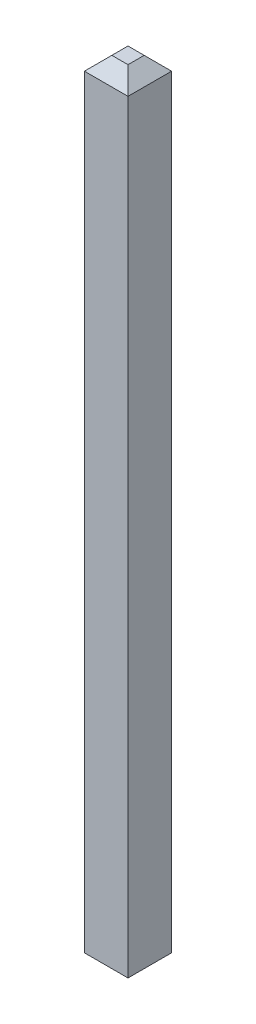
ISO-10303-21;
HEADER;
FILE_DESCRIPTION(('STEP AP214'),'2;1');
FILE_NAME('part.step','',(''),(''),'','','');
FILE_SCHEMA(('AUTOMOTIVE_DESIGN { 1 0 10303 214 1 1 1 1 }'));
ENDSEC;
DATA;
#1=APPLICATION_CONTEXT('core data for automotive mechanical design processes');
#2=APPLICATION_PROTOCOL_DEFINITION('international standard','automotive_design',2000,#1);
#3=PRODUCT_CONTEXT('',#1,'mechanical');
#4=PRODUCT('Part','Part','',(#3));
#5=PRODUCT_RELATED_PRODUCT_CATEGORY('part','',(#4));
#6=PRODUCT_DEFINITION_FORMATION('','',#4);
#7=PRODUCT_DEFINITION_CONTEXT('part definition',#1,'design');
#8=PRODUCT_DEFINITION('design','',#6,#7);
#9=PRODUCT_DEFINITION_SHAPE('','',#8);
#10=(LENGTH_UNIT() NAMED_UNIT(*) SI_UNIT(.MILLI.,.METRE.));
#11=(NAMED_UNIT(*) PLANE_ANGLE_UNIT() SI_UNIT($,.RADIAN.));
#12=(NAMED_UNIT(*) SI_UNIT($,.STERADIAN.) SOLID_ANGLE_UNIT());
#13=UNCERTAINTY_MEASURE_WITH_UNIT(LENGTH_MEASURE(1.E-05),#10,'distance_accuracy_value','');
#14=(GEOMETRIC_REPRESENTATION_CONTEXT(3) GLOBAL_UNCERTAINTY_ASSIGNED_CONTEXT((#13)) GLOBAL_UNIT_ASSIGNED_CONTEXT((#10,
#11,#12)) REPRESENTATION_CONTEXT('',''));
#15=CARTESIAN_POINT('',(0.,0.,0.));
#16=DIRECTION('',(0.,0.,1.));
#17=DIRECTION('',(1.,0.,0.));
#18=AXIS2_PLACEMENT_3D('',#15,#16,#17);
#19=CARTESIAN_POINT('',(0.,11.54,0.));
#20=DIRECTION('',(1.,0.,0.));
#21=DIRECTION('',(0.,0.,-1.));
#22=AXIS2_PLACEMENT_3D('',#19,#20,#21);
#23=PLANE('',#22);
#24=DIRECTION('',(0.,-1.,0.));
#25=VECTOR('',#24,1.);
#26=CARTESIAN_POINT('',(0.,11.54,0.636));
#27=LINE('',#26,#25);
#28=CARTESIAN_POINT('',(0.,11.34,0.636));
#29=VERTEX_POINT('',#28);
#30=CARTESIAN_POINT('',(0.,0.199999999999999,0.636));
#31=VERTEX_POINT('',#30);
#32=EDGE_CURVE('E128',#29,#31,#27,.T.);
#33=ORIENTED_EDGE('',*,*,#32,.F.);
#34=DIRECTION('',(0.,0.,-1.));
#35=VECTOR('',#34,1.);
#36=CARTESIAN_POINT('',(0.,11.34,0.));
#37=LINE('',#36,#35);
#38=CARTESIAN_POINT('',(0.,11.34,0.));
#39=VERTEX_POINT('',#38);
#40=EDGE_CURVE('E153',#29,#39,#37,.T.);
#41=ORIENTED_EDGE('',*,*,#40,.T.);
#42=DIRECTION('',(0.,-1.,0.));
#43=VECTOR('',#42,1.);
#44=CARTESIAN_POINT('',(0.,11.54,0.));
#45=LINE('',#44,#43);
#46=CARTESIAN_POINT('',(0.,0.199999999999999,0.));
#47=VERTEX_POINT('',#46);
#48=EDGE_CURVE('E122',#39,#47,#45,.T.);
#49=ORIENTED_EDGE('',*,*,#48,.T.);
#50=DIRECTION('',(0.,0.,1.));
#51=VECTOR('',#50,1.);
#52=CARTESIAN_POINT('',(0.,0.199999999999999,0.));
#53=LINE('',#52,#51);
#54=EDGE_CURVE('E150',#47,#31,#53,.T.);
#55=ORIENTED_EDGE('',*,*,#54,.T.);
#56=EDGE_LOOP('',(#33,#41,#49,#55));
#57=FACE_BOUND('',#56,.T.);
#58=ADVANCED_FACE('F36',(#57),#23,.F.);
#59=CARTESIAN_POINT('',(0.,11.54,0.636));
#60=DIRECTION('',(0.,0.,-1.));
#61=DIRECTION('',(-1.,0.,0.));
#62=AXIS2_PLACEMENT_3D('',#59,#60,#61);
#63=PLANE('',#62);
#64=DIRECTION('',(0.,-1.,0.));
#65=VECTOR('',#64,1.);
#66=CARTESIAN_POINT('',(0.636,11.54,0.636));
#67=LINE('',#66,#65);
#68=CARTESIAN_POINT('',(0.636,11.34,0.636));
#69=VERTEX_POINT('',#68);
#70=CARTESIAN_POINT('',(0.636,0.199999999999999,0.636));
#71=VERTEX_POINT('',#70);
#72=EDGE_CURVE('E131',#69,#71,#67,.T.);
#73=ORIENTED_EDGE('',*,*,#72,.F.);
#74=DIRECTION('',(-1.,0.,0.));
#75=VECTOR('',#74,1.);
#76=CARTESIAN_POINT('',(0.,11.34,0.636));
#77=LINE('',#76,#75);
#78=EDGE_CURVE('E140',#69,#29,#77,.T.);
#79=ORIENTED_EDGE('',*,*,#78,.T.);
#80=ORIENTED_EDGE('',*,*,#32,.T.);
#81=DIRECTION('',(1.,0.,0.));
#82=VECTOR('',#81,1.);
#83=CARTESIAN_POINT('',(0.,0.199999999999999,0.636));
#84=LINE('',#83,#82);
#85=EDGE_CURVE('E138',#31,#71,#84,.T.);
#86=ORIENTED_EDGE('',*,*,#85,.T.);
#87=EDGE_LOOP('',(#73,#79,#80,#86));
#88=FACE_BOUND('',#87,.T.);
#89=ADVANCED_FACE('F190',(#88),#63,.F.);
#90=CARTESIAN_POINT('',(0.636,11.54,0.));
#91=DIRECTION('',(-1.,0.,0.));
#92=DIRECTION('',(0.,0.,1.));
#93=AXIS2_PLACEMENT_3D('',#90,#91,#92);
#94=PLANE('',#93);
#95=DIRECTION('',(0.,-1.,0.));
#96=VECTOR('',#95,1.);
#97=CARTESIAN_POINT('',(0.636,11.54,0.));
#98=LINE('',#97,#96);
#99=CARTESIAN_POINT('',(0.636,11.34,0.));
#100=VERTEX_POINT('',#99);
#101=CARTESIAN_POINT('',(0.636,0.199999999999999,0.));
#102=VERTEX_POINT('',#101);
#103=EDGE_CURVE('E202',#100,#102,#98,.T.);
#104=ORIENTED_EDGE('',*,*,#103,.F.);
#105=DIRECTION('',(0.,0.,1.));
#106=VECTOR('',#105,1.);
#107=CARTESIAN_POINT('',(0.636,11.34,0.636));
#108=LINE('',#107,#106);
#109=EDGE_CURVE('E145',#100,#69,#108,.T.);
#110=ORIENTED_EDGE('',*,*,#109,.T.);
#111=ORIENTED_EDGE('',*,*,#72,.T.);
#112=DIRECTION('',(0.,0.,-1.));
#113=VECTOR('',#112,1.);
#114=CARTESIAN_POINT('',(0.636,0.199999999999999,0.));
#115=LINE('',#114,#113);
#116=EDGE_CURVE('E143',#71,#102,#115,.T.);
#117=ORIENTED_EDGE('',*,*,#116,.T.);
#118=EDGE_LOOP('',(#104,#110,#111,#117));
#119=FACE_BOUND('',#118,.T.);
#120=ADVANCED_FACE('F200',(#119),#94,.F.);
#121=CARTESIAN_POINT('',(0.,11.54,0.));
#122=DIRECTION('',(0.,0.,1.));
#123=DIRECTION('',(1.,0.,0.));
#124=AXIS2_PLACEMENT_3D('',#121,#122,#123);
#125=PLANE('',#124);
#126=ORIENTED_EDGE('',*,*,#48,.F.);
#127=DIRECTION('',(1.,0.,0.));
#128=VECTOR('',#127,1.);
#129=CARTESIAN_POINT('',(0.636,11.34,0.));
#130=LINE('',#129,#128);
#131=EDGE_CURVE('E119',#39,#100,#130,.T.);
#132=ORIENTED_EDGE('',*,*,#131,.T.);
#133=ORIENTED_EDGE('',*,*,#103,.T.);
#134=DIRECTION('',(-1.,0.,0.));
#135=VECTOR('',#134,1.);
#136=CARTESIAN_POINT('',(0.,0.199999999999999,0.));
#137=LINE('',#136,#135);
#138=EDGE_CURVE('E147',#102,#47,#137,.T.);
#139=ORIENTED_EDGE('',*,*,#138,.T.);
#140=EDGE_LOOP('',(#126,#132,#133,#139));
#141=FACE_BOUND('',#140,.T.);
#142=ADVANCED_FACE('F206',(#141),#125,.F.);
#143=CARTESIAN_POINT('',(0.,11.54,0.));
#144=DIRECTION('',(0.,1.,0.));
#145=DIRECTION('',(0.,0.,1.));
#146=AXIS2_PLACEMENT_3D('',#143,#144,#145);
#147=PLANE('',#146);
#148=DIRECTION('',(0.,0.,1.));
#149=VECTOR('',#148,1.);
#150=CARTESIAN_POINT('',(0.199999999999999,11.54,0.636));
#151=LINE('',#150,#149);
#152=CARTESIAN_POINT('',(0.199999999999999,11.54,0.199999999999999));
#153=VERTEX_POINT('',#152);
#154=CARTESIAN_POINT('',(0.199999999999999,11.54,0.436000000000001));
#155=VERTEX_POINT('',#154);
#156=EDGE_CURVE('E107',#153,#155,#151,.T.);
#157=ORIENTED_EDGE('',*,*,#156,.T.);
#158=DIRECTION('',(1.,0.,0.));
#159=VECTOR('',#158,1.);
#160=CARTESIAN_POINT('',(0.636,11.54,0.436000000000001));
#161=LINE('',#160,#159);
#162=CARTESIAN_POINT('',(0.436000000000001,11.54,0.436000000000001));
#163=VERTEX_POINT('',#162);
#164=EDGE_CURVE('E136',#155,#163,#161,.T.);
#165=ORIENTED_EDGE('',*,*,#164,.T.);
#166=DIRECTION('',(0.,0.,-1.));
#167=VECTOR('',#166,1.);
#168=CARTESIAN_POINT('',(0.436000000000001,11.54,0.));
#169=LINE('',#168,#167);
#170=CARTESIAN_POINT('',(0.436000000000001,11.54,0.199999999999999));
#171=VERTEX_POINT('',#170);
#172=EDGE_CURVE('E110',#163,#171,#169,.T.);
#173=ORIENTED_EDGE('',*,*,#172,.T.);
#174=DIRECTION('',(-1.,0.,0.));
#175=VECTOR('',#174,1.);
#176=CARTESIAN_POINT('',(0.,11.54,0.199999999999999));
#177=LINE('',#176,#175);
#178=EDGE_CURVE('E102',#171,#153,#177,.T.);
#179=ORIENTED_EDGE('',*,*,#178,.T.);
#180=EDGE_LOOP('',(#157,#165,#173,#179));
#181=FACE_BOUND('',#180,.T.);
#182=ADVANCED_FACE('F104',(#181),#147,.T.);
#183=CARTESIAN_POINT('',(0.,0.,0.));
#184=DIRECTION('',(0.,1.,0.));
#185=DIRECTION('',(0.,0.,1.));
#186=AXIS2_PLACEMENT_3D('',#183,#184,#185);
#187=PLANE('',#186);
#188=DIRECTION('',(-1.,0.,0.));
#189=VECTOR('',#188,1.);
#190=CARTESIAN_POINT('',(0.,0.,0.436000000000001));
#191=LINE('',#190,#189);
#192=CARTESIAN_POINT('',(0.436000000000001,0.,0.436000000000001));
#193=VERTEX_POINT('',#192);
#194=CARTESIAN_POINT('',(0.199999999999999,0.,0.436000000000001));
#195=VERTEX_POINT('',#194);
#196=EDGE_CURVE('E155',#193,#195,#191,.T.);
#197=ORIENTED_EDGE('',*,*,#196,.T.);
#198=DIRECTION('',(0.,0.,-1.));
#199=VECTOR('',#198,1.);
#200=CARTESIAN_POINT('',(0.199999999999999,0.,0.));
#201=LINE('',#200,#199);
#202=CARTESIAN_POINT('',(0.199999999999999,0.,0.199999999999999));
#203=VERTEX_POINT('',#202);
#204=EDGE_CURVE('E11',#195,#203,#201,.T.);
#205=ORIENTED_EDGE('',*,*,#204,.T.);
#206=DIRECTION('',(1.,0.,0.));
#207=VECTOR('',#206,1.);
#208=CARTESIAN_POINT('',(0.,0.,0.199999999999999));
#209=LINE('',#208,#207);
#210=CARTESIAN_POINT('',(0.436000000000001,0.,0.199999999999999));
#211=VERTEX_POINT('',#210);
#212=EDGE_CURVE('E45',#203,#211,#209,.T.);
#213=ORIENTED_EDGE('',*,*,#212,.T.);
#214=DIRECTION('',(0.,0.,1.));
#215=VECTOR('',#214,1.);
#216=CARTESIAN_POINT('',(0.436000000000001,0.,0.));
#217=LINE('',#216,#215);
#218=EDGE_CURVE('E157',#211,#193,#217,.T.);
#219=ORIENTED_EDGE('',*,*,#218,.T.);
#220=EDGE_LOOP('',(#197,#205,#213,#219));
#221=FACE_BOUND('',#220,.T.);
#222=ADVANCED_FACE('F179',(#221),#187,.F.);
#223=CARTESIAN_POINT('',(0.,11.54,0.199999999999999));
#224=DIRECTION('',(0.,0.707106781186548,-0.707106781186548));
#225=DIRECTION('',(1.,0.,0.));
#226=AXIS2_PLACEMENT_3D('',#223,#224,#225);
#227=PLANE('',#226);
#228=DIRECTION('',(0.577350269189626,-0.577350269189626,-0.577350269189626));
#229=VECTOR('',#228,1.);
#230=CARTESIAN_POINT('',(0.290666666666668,11.6853333333333,0.345333333333333));
#231=LINE('',#230,#229);
#232=EDGE_CURVE('E123',#100,#171,#231,.F.);
#233=ORIENTED_EDGE('',*,*,#232,.F.);
#234=ORIENTED_EDGE('',*,*,#131,.F.);
#235=DIRECTION('',(-0.577350269189626,-0.577350269189626,-0.577350269189626));
#236=VECTOR('',#235,1.);
#237=CARTESIAN_POINT('',(0.133333333333333,11.4733333333333,0.133333333333332));
#238=LINE('',#237,#236);
#239=EDGE_CURVE('E117',#153,#39,#238,.T.);
#240=ORIENTED_EDGE('',*,*,#239,.F.);
#241=ORIENTED_EDGE('',*,*,#178,.F.);
#242=EDGE_LOOP('',(#233,#234,#240,#241));
#243=FACE_BOUND('',#242,.T.);
#244=ADVANCED_FACE('F118',(#243),#227,.T.);
#245=CARTESIAN_POINT('',(0.199999999999999,11.54,0.));
#246=DIRECTION('',(-0.707106781186548,0.707106781186548,0.));
#247=DIRECTION('',(0.,0.,-1.));
#248=AXIS2_PLACEMENT_3D('',#245,#246,#247);
#249=PLANE('',#248);
#250=ORIENTED_EDGE('',*,*,#239,.T.);
#251=ORIENTED_EDGE('',*,*,#40,.F.);
#252=DIRECTION('',(0.577350269189626,0.577350269189626,-0.577350269189626));
#253=VECTOR('',#252,1.);
#254=CARTESIAN_POINT('',(0.345333333333333,11.6853333333333,0.290666666666668));
#255=LINE('',#254,#253);
#256=EDGE_CURVE('E126',#155,#29,#255,.F.);
#257=ORIENTED_EDGE('',*,*,#256,.F.);
#258=ORIENTED_EDGE('',*,*,#156,.F.);
#259=EDGE_LOOP('',(#250,#251,#257,#258));
#260=FACE_BOUND('',#259,.T.);
#261=ADVANCED_FACE('F125',(#260),#249,.T.);
#262=CARTESIAN_POINT('',(0.436000000000001,11.54,0.));
#263=DIRECTION('',(0.707106781186548,0.707106781186548,0.));
#264=DIRECTION('',(0.,0.,1.));
#265=AXIS2_PLACEMENT_3D('',#262,#263,#264);
#266=PLANE('',#265);
#267=ORIENTED_EDGE('',*,*,#232,.T.);
#268=ORIENTED_EDGE('',*,*,#172,.F.);
#269=DIRECTION('',(0.577350269189626,-0.577350269189626,0.577350269189626));
#270=VECTOR('',#269,1.);
#271=CARTESIAN_POINT('',(0.290666666666668,11.6853333333333,0.290666666666667));
#272=LINE('',#271,#270);
#273=EDGE_CURVE('E160',#69,#163,#272,.F.);
#274=ORIENTED_EDGE('',*,*,#273,.F.);
#275=ORIENTED_EDGE('',*,*,#109,.F.);
#276=EDGE_LOOP('',(#267,#268,#274,#275));
#277=FACE_BOUND('',#276,.T.);
#278=ADVANCED_FACE('F197',(#277),#266,.T.);
#279=CARTESIAN_POINT('',(0.,11.54,0.436000000000001));
#280=DIRECTION('',(0.,0.707106781186548,0.707106781186548));
#281=DIRECTION('',(-1.,0.,0.));
#282=AXIS2_PLACEMENT_3D('',#279,#280,#281);
#283=PLANE('',#282);
#284=ORIENTED_EDGE('',*,*,#256,.T.);
#285=ORIENTED_EDGE('',*,*,#78,.F.);
#286=ORIENTED_EDGE('',*,*,#273,.T.);
#287=ORIENTED_EDGE('',*,*,#164,.F.);
#288=EDGE_LOOP('',(#284,#285,#286,#287));
#289=FACE_BOUND('',#288,.T.);
#290=ADVANCED_FACE('F194',(#289),#283,.T.);
#291=CARTESIAN_POINT('',(0.636,0.199999999999999,0.));
#292=DIRECTION('',(-0.707106781186548,0.707106781186548,0.));
#293=DIRECTION('',(0.,0.,-1.));
#294=AXIS2_PLACEMENT_3D('',#291,#292,#293);
#295=PLANE('',#294);
#296=DIRECTION('',(0.577350269189626,0.577350269189626,0.577350269189626));
#297=VECTOR('',#296,1.);
#298=CARTESIAN_POINT('',(0.424,-0.0120000000000012,0.424));
#299=LINE('',#298,#297);
#300=EDGE_CURVE('E166',#193,#71,#299,.T.);
#301=ORIENTED_EDGE('',*,*,#300,.F.);
#302=ORIENTED_EDGE('',*,*,#218,.F.);
#303=DIRECTION('',(0.577350269189626,0.577350269189626,-0.577350269189626));
#304=VECTOR('',#303,1.);
#305=CARTESIAN_POINT('',(0.636,0.199999999999999,0.));
#306=LINE('',#305,#304);
#307=EDGE_CURVE('E40',#102,#211,#306,.F.);
#308=ORIENTED_EDGE('',*,*,#307,.F.);
#309=ORIENTED_EDGE('',*,*,#116,.F.);
#310=EDGE_LOOP('',(#301,#302,#308,#309));
#311=FACE_BOUND('',#310,.T.);
#312=ADVANCED_FACE('F38',(#311),#295,.F.);
#313=CARTESIAN_POINT('',(0.,0.199999999999999,0.));
#314=DIRECTION('',(0.,0.707106781186548,0.707106781186548));
#315=DIRECTION('',(-1.,0.,0.));
#316=AXIS2_PLACEMENT_3D('',#313,#314,#315);
#317=PLANE('',#316);
#318=ORIENTED_EDGE('',*,*,#307,.T.);
#319=ORIENTED_EDGE('',*,*,#212,.F.);
#320=DIRECTION('',(-0.577350269189626,0.577350269189626,-0.577350269189626));
#321=VECTOR('',#320,1.);
#322=CARTESIAN_POINT('',(0.,0.199999999999999,0.));
#323=LINE('',#322,#321);
#324=EDGE_CURVE('E53',#47,#203,#323,.F.);
#325=ORIENTED_EDGE('',*,*,#324,.F.);
#326=ORIENTED_EDGE('',*,*,#138,.F.);
#327=EDGE_LOOP('',(#318,#319,#325,#326));
#328=FACE_BOUND('',#327,.T.);
#329=ADVANCED_FACE('F176',(#328),#317,.F.);
#330=CARTESIAN_POINT('',(0.,0.199999999999999,0.636));
#331=DIRECTION('',(0.,0.707106781186548,-0.707106781186548));
#332=DIRECTION('',(1.,0.,0.));
#333=AXIS2_PLACEMENT_3D('',#330,#331,#332);
#334=PLANE('',#333);
#335=ORIENTED_EDGE('',*,*,#300,.T.);
#336=ORIENTED_EDGE('',*,*,#85,.F.);
#337=DIRECTION('',(0.577350269189626,-0.577350269189626,-0.577350269189626));
#338=VECTOR('',#337,1.);
#339=CARTESIAN_POINT('',(0.,0.199999999999999,0.636));
#340=LINE('',#339,#338);
#341=EDGE_CURVE('E164',#195,#31,#340,.F.);
#342=ORIENTED_EDGE('',*,*,#341,.F.);
#343=ORIENTED_EDGE('',*,*,#196,.F.);
#344=EDGE_LOOP('',(#335,#336,#342,#343));
#345=FACE_BOUND('',#344,.T.);
#346=ADVANCED_FACE('F182',(#345),#334,.F.);
#347=CARTESIAN_POINT('',(0.,0.199999999999999,0.));
#348=DIRECTION('',(0.707106781186548,0.707106781186548,0.));
#349=DIRECTION('',(0.,0.,1.));
#350=AXIS2_PLACEMENT_3D('',#347,#348,#349);
#351=PLANE('',#350);
#352=ORIENTED_EDGE('',*,*,#324,.T.);
#353=ORIENTED_EDGE('',*,*,#204,.F.);
#354=ORIENTED_EDGE('',*,*,#341,.T.);
#355=ORIENTED_EDGE('',*,*,#54,.F.);
#356=EDGE_LOOP('',(#352,#353,#354,#355));
#357=FACE_BOUND('',#356,.T.);
#358=ADVANCED_FACE('F181',(#357),#351,.F.);
#359=CLOSED_SHELL('',(#58,#89,#120,#142,#182,#222,#244,#261,#278,#290,#312,#329,#346,#358));
#360=MANIFOLD_SOLID_BREP('B2',#359);
#361=ADVANCED_BREP_SHAPE_REPRESENTATION('',(#18,#360),#14);
#362=SHAPE_DEFINITION_REPRESENTATION(#9,#361);
ENDSEC;
END-ISO-10303-21;
